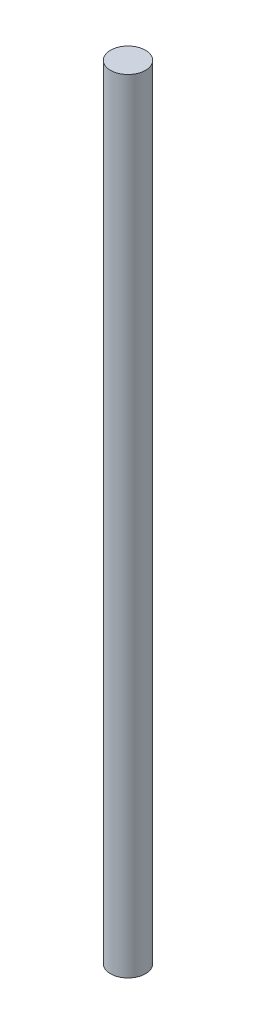
ISO-10303-21;
HEADER;
FILE_DESCRIPTION(('STEP AP214'),'2;1');
FILE_NAME('part.step','',(''),(''),'','','');
FILE_SCHEMA(('AUTOMOTIVE_DESIGN { 1 0 10303 214 1 1 1 1 }'));
ENDSEC;
DATA;
#1=APPLICATION_CONTEXT('core data for automotive mechanical design processes');
#2=APPLICATION_PROTOCOL_DEFINITION('international standard','automotive_design',2000,#1);
#3=PRODUCT_CONTEXT('',#1,'mechanical');
#4=PRODUCT('Part','Part','',(#3));
#5=PRODUCT_RELATED_PRODUCT_CATEGORY('part','',(#4));
#6=PRODUCT_DEFINITION_FORMATION('','',#4);
#7=PRODUCT_DEFINITION_CONTEXT('part definition',#1,'design');
#8=PRODUCT_DEFINITION('design','',#6,#7);
#9=PRODUCT_DEFINITION_SHAPE('','',#8);
#10=(LENGTH_UNIT() NAMED_UNIT(*) SI_UNIT(.MILLI.,.METRE.));
#11=(NAMED_UNIT(*) PLANE_ANGLE_UNIT() SI_UNIT($,.RADIAN.));
#12=(NAMED_UNIT(*) SI_UNIT($,.STERADIAN.) SOLID_ANGLE_UNIT());
#13=UNCERTAINTY_MEASURE_WITH_UNIT(LENGTH_MEASURE(1.E-05),#10,'distance_accuracy_value','');
#14=(GEOMETRIC_REPRESENTATION_CONTEXT(3) GLOBAL_UNCERTAINTY_ASSIGNED_CONTEXT((#13)) GLOBAL_UNIT_ASSIGNED_CONTEXT((#10,
#11,#12)) REPRESENTATION_CONTEXT('',''));
#15=CARTESIAN_POINT('',(0.,0.,0.));
#16=DIRECTION('',(0.,0.,1.));
#17=DIRECTION('',(1.,0.,0.));
#18=AXIS2_PLACEMENT_3D('',#15,#16,#17);
#19=CARTESIAN_POINT('',(0.,177.8,0.));
#20=DIRECTION('',(0.,-1.,0.));
#21=DIRECTION('',(0.,0.,-1.));
#22=AXIS2_PLACEMENT_3D('',#19,#20,#21);
#23=CYLINDRICAL_SURFACE('',#22,3.96875);
#24=CARTESIAN_POINT('',(0.,177.8,0.));
#25=DIRECTION('',(0.,1.,0.));
#26=DIRECTION('',(0.,0.,1.));
#27=AXIS2_PLACEMENT_3D('',#24,#25,#26);
#28=CIRCLE('',#27,3.96875);
#29=CARTESIAN_POINT('',(0.,177.8,3.96875));
#30=VERTEX_POINT('',#29);
#31=EDGE_CURVE('E10',#30,#30,#28,.T.);
#32=ORIENTED_EDGE('',*,*,#31,.F.);
#33=EDGE_LOOP('',(#32));
#34=FACE_BOUND('',#33,.T.);
#35=CARTESIAN_POINT('',(0.,0.,0.));
#36=DIRECTION('',(0.,1.,0.));
#37=DIRECTION('',(0.,0.,1.));
#38=AXIS2_PLACEMENT_3D('',#35,#36,#37);
#39=CIRCLE('',#38,3.96875);
#40=CARTESIAN_POINT('',(0.,0.,3.96875));
#41=VERTEX_POINT('',#40);
#42=EDGE_CURVE('E34',#41,#41,#39,.T.);
#43=ORIENTED_EDGE('',*,*,#42,.T.);
#44=EDGE_LOOP('',(#43));
#45=FACE_BOUND('',#44,.T.);
#46=ADVANCED_FACE('F31',(#34,#45),#23,.T.);
#47=CARTESIAN_POINT('',(0.,177.8,0.));
#48=DIRECTION('',(0.,1.,0.));
#49=DIRECTION('',(0.,0.,1.));
#50=AXIS2_PLACEMENT_3D('',#47,#48,#49);
#51=PLANE('',#50);
#52=ORIENTED_EDGE('',*,*,#31,.T.);
#53=EDGE_LOOP('',(#52));
#54=FACE_BOUND('',#53,.T.);
#55=ADVANCED_FACE('F46',(#54),#51,.T.);
#56=CARTESIAN_POINT('',(0.,0.,0.));
#57=DIRECTION('',(0.,1.,0.));
#58=DIRECTION('',(0.,0.,1.));
#59=AXIS2_PLACEMENT_3D('',#56,#57,#58);
#60=PLANE('',#59);
#61=ORIENTED_EDGE('',*,*,#42,.F.);
#62=EDGE_LOOP('',(#61));
#63=FACE_BOUND('',#62,.T.);
#64=ADVANCED_FACE('F44',(#63),#60,.F.);
#65=CLOSED_SHELL('',(#46,#55,#64));
#66=MANIFOLD_SOLID_BREP('B2',#65);
#67=ADVANCED_BREP_SHAPE_REPRESENTATION('',(#18,#66),#14);
#68=SHAPE_DEFINITION_REPRESENTATION(#9,#67);
ENDSEC;
END-ISO-10303-21;
